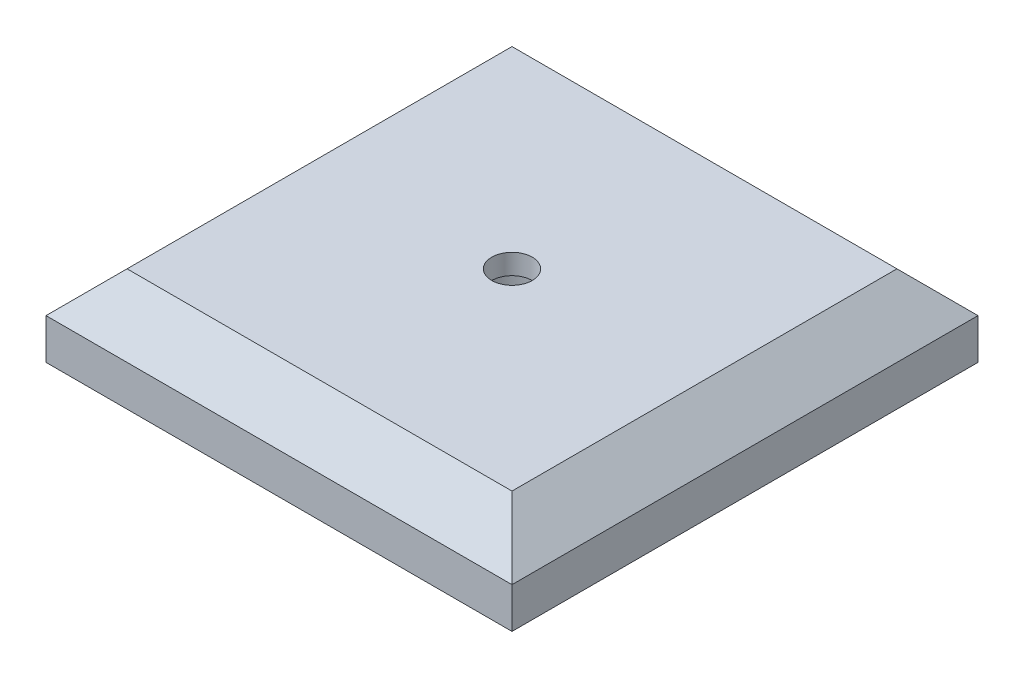
ISO-10303-21;
HEADER;
FILE_DESCRIPTION(('STEP AP214'),'2;1');
FILE_NAME('part.step','',(''),(''),'','','');
FILE_SCHEMA(('AUTOMOTIVE_DESIGN { 1 0 10303 214 1 1 1 1 }'));
ENDSEC;
DATA;
#1=APPLICATION_CONTEXT('core data for automotive mechanical design processes');
#2=APPLICATION_PROTOCOL_DEFINITION('international standard','automotive_design',2000,#1);
#3=PRODUCT_CONTEXT('',#1,'mechanical');
#4=PRODUCT('Part','Part','',(#3));
#5=PRODUCT_RELATED_PRODUCT_CATEGORY('part','',(#4));
#6=PRODUCT_DEFINITION_FORMATION('','',#4);
#7=PRODUCT_DEFINITION_CONTEXT('part definition',#1,'design');
#8=PRODUCT_DEFINITION('design','',#6,#7);
#9=PRODUCT_DEFINITION_SHAPE('','',#8);
#10=(LENGTH_UNIT() NAMED_UNIT(*) SI_UNIT(.MILLI.,.METRE.));
#11=(NAMED_UNIT(*) PLANE_ANGLE_UNIT() SI_UNIT($,.RADIAN.));
#12=(NAMED_UNIT(*) SI_UNIT($,.STERADIAN.) SOLID_ANGLE_UNIT());
#13=UNCERTAINTY_MEASURE_WITH_UNIT(LENGTH_MEASURE(1.E-05),#10,'distance_accuracy_value','');
#14=(GEOMETRIC_REPRESENTATION_CONTEXT(3) GLOBAL_UNCERTAINTY_ASSIGNED_CONTEXT((#13)) GLOBAL_UNIT_ASSIGNED_CONTEXT((#10,
#11,#12)) REPRESENTATION_CONTEXT('',''));
#15=CARTESIAN_POINT('',(0.,0.,0.));
#16=DIRECTION('',(0.,0.,1.));
#17=DIRECTION('',(1.,0.,0.));
#18=AXIS2_PLACEMENT_3D('',#15,#16,#17);
#19=CARTESIAN_POINT('',(14.375,2.5,-14.375));
#20=DIRECTION('',(-1.,0.,0.));
#21=DIRECTION('',(0.,0.,1.));
#22=AXIS2_PLACEMENT_3D('',#19,#20,#21);
#23=PLANE('',#22);
#24=DIRECTION('',(0.,0.,-1.));
#25=VECTOR('',#24,1.);
#26=CARTESIAN_POINT('',(14.375,0.,-14.375));
#27=LINE('',#26,#25);
#28=CARTESIAN_POINT('',(14.375,0.,14.375));
#29=VERTEX_POINT('',#28);
#30=CARTESIAN_POINT('',(14.375,0.,-14.375));
#31=VERTEX_POINT('',#30);
#32=EDGE_CURVE('E141',#29,#31,#27,.T.);
#33=ORIENTED_EDGE('',*,*,#32,.T.);
#34=DIRECTION('',(0.,-1.,0.));
#35=VECTOR('',#34,1.);
#36=CARTESIAN_POINT('',(14.375,2.5,-14.375));
#37=LINE('',#36,#35);
#38=CARTESIAN_POINT('',(14.375,2.5,-14.375));
#39=VERTEX_POINT('',#38);
#40=EDGE_CURVE('E11',#39,#31,#37,.T.);
#41=ORIENTED_EDGE('',*,*,#40,.F.);
#42=DIRECTION('',(0.,0.,-1.));
#43=VECTOR('',#42,1.);
#44=CARTESIAN_POINT('',(14.375,2.5,-14.375));
#45=LINE('',#44,#43);
#46=CARTESIAN_POINT('',(14.375,2.5,14.375));
#47=VERTEX_POINT('',#46);
#48=EDGE_CURVE('E94',#47,#39,#45,.T.);
#49=ORIENTED_EDGE('',*,*,#48,.F.);
#50=DIRECTION('',(0.,-1.,0.));
#51=VECTOR('',#50,1.);
#52=CARTESIAN_POINT('',(14.375,2.5,14.375));
#53=LINE('',#52,#51);
#54=EDGE_CURVE('E96',#47,#29,#53,.T.);
#55=ORIENTED_EDGE('',*,*,#54,.T.);
#56=EDGE_LOOP('',(#33,#41,#49,#55));
#57=FACE_BOUND('',#56,.T.);
#58=ADVANCED_FACE('F34',(#57),#23,.F.);
#59=CARTESIAN_POINT('',(-14.375,2.5,-14.375));
#60=DIRECTION('',(0.,0.,1.));
#61=DIRECTION('',(1.,0.,0.));
#62=AXIS2_PLACEMENT_3D('',#59,#60,#61);
#63=PLANE('',#62);
#64=DIRECTION('',(-1.,0.,0.));
#65=VECTOR('',#64,1.);
#66=CARTESIAN_POINT('',(-14.375,0.,-14.375));
#67=LINE('',#66,#65);
#68=CARTESIAN_POINT('',(-14.375,0.,-14.375));
#69=VERTEX_POINT('',#68);
#70=EDGE_CURVE('E143',#31,#69,#67,.T.);
#71=ORIENTED_EDGE('',*,*,#70,.T.);
#72=DIRECTION('',(0.,-1.,0.));
#73=VECTOR('',#72,1.);
#74=CARTESIAN_POINT('',(-14.375,2.5,-14.375));
#75=LINE('',#74,#73);
#76=CARTESIAN_POINT('',(-14.375,2.5,-14.375));
#77=VERTEX_POINT('',#76);
#78=EDGE_CURVE('E42',#77,#69,#75,.T.);
#79=ORIENTED_EDGE('',*,*,#78,.F.);
#80=DIRECTION('',(-1.,0.,0.));
#81=VECTOR('',#80,1.);
#82=CARTESIAN_POINT('',(-14.375,2.5,-14.375));
#83=LINE('',#82,#81);
#84=EDGE_CURVE('E76',#39,#77,#83,.T.);
#85=ORIENTED_EDGE('',*,*,#84,.F.);
#86=ORIENTED_EDGE('',*,*,#40,.T.);
#87=EDGE_LOOP('',(#71,#79,#85,#86));
#88=FACE_BOUND('',#87,.T.);
#89=ADVANCED_FACE('F150',(#88),#63,.F.);
#90=CARTESIAN_POINT('',(-14.375,2.5,-14.375));
#91=DIRECTION('',(1.,0.,0.));
#92=DIRECTION('',(0.,0.,-1.));
#93=AXIS2_PLACEMENT_3D('',#90,#91,#92);
#94=PLANE('',#93);
#95=DIRECTION('',(0.,0.,1.));
#96=VECTOR('',#95,1.);
#97=CARTESIAN_POINT('',(-14.375,0.,-14.375));
#98=LINE('',#97,#96);
#99=CARTESIAN_POINT('',(-14.375,0.,14.375));
#100=VERTEX_POINT('',#99);
#101=EDGE_CURVE('E66',#69,#100,#98,.T.);
#102=ORIENTED_EDGE('',*,*,#101,.T.);
#103=DIRECTION('',(0.,-1.,0.));
#104=VECTOR('',#103,1.);
#105=CARTESIAN_POINT('',(-14.375,2.5,14.375));
#106=LINE('',#105,#104);
#107=CARTESIAN_POINT('',(-14.375,2.5,14.375));
#108=VERTEX_POINT('',#107);
#109=EDGE_CURVE('E50',#108,#100,#106,.T.);
#110=ORIENTED_EDGE('',*,*,#109,.F.);
#111=DIRECTION('',(0.,0.,1.));
#112=VECTOR('',#111,1.);
#113=CARTESIAN_POINT('',(-14.375,2.5,-14.375));
#114=LINE('',#113,#112);
#115=EDGE_CURVE('E117',#77,#108,#114,.T.);
#116=ORIENTED_EDGE('',*,*,#115,.F.);
#117=ORIENTED_EDGE('',*,*,#78,.T.);
#118=EDGE_LOOP('',(#102,#110,#116,#117));
#119=FACE_BOUND('',#118,.T.);
#120=ADVANCED_FACE('F147',(#119),#94,.F.);
#121=CARTESIAN_POINT('',(-14.375,2.5,14.375));
#122=DIRECTION('',(0.,0.,-1.));
#123=DIRECTION('',(-1.,0.,0.));
#124=AXIS2_PLACEMENT_3D('',#121,#122,#123);
#125=PLANE('',#124);
#126=DIRECTION('',(1.,0.,0.));
#127=VECTOR('',#126,1.);
#128=CARTESIAN_POINT('',(-14.375,0.,14.375));
#129=LINE('',#128,#127);
#130=EDGE_CURVE('E71',#100,#29,#129,.T.);
#131=ORIENTED_EDGE('',*,*,#130,.T.);
#132=ORIENTED_EDGE('',*,*,#54,.F.);
#133=DIRECTION('',(1.,0.,0.));
#134=VECTOR('',#133,1.);
#135=CARTESIAN_POINT('',(-14.375,2.5,14.375));
#136=LINE('',#135,#134);
#137=EDGE_CURVE('E105',#108,#47,#136,.T.);
#138=ORIENTED_EDGE('',*,*,#137,.F.);
#139=ORIENTED_EDGE('',*,*,#109,.T.);
#140=EDGE_LOOP('',(#131,#132,#138,#139));
#141=FACE_BOUND('',#140,.T.);
#142=ADVANCED_FACE('F104',(#141),#125,.F.);
#143=CARTESIAN_POINT('',(0.,0.,0.));
#144=DIRECTION('',(0.,1.,0.));
#145=DIRECTION('',(0.,0.,1.));
#146=AXIS2_PLACEMENT_3D('',#143,#144,#145);
#147=PLANE('',#146);
#148=CARTESIAN_POINT('',(0.,0.,0.));
#149=DIRECTION('',(0.,-1.,0.));
#150=DIRECTION('',(0.,0.,-1.));
#151=AXIS2_PLACEMENT_3D('',#148,#149,#150);
#152=CIRCLE('',#151,2.5);
#153=CARTESIAN_POINT('',(0.,0.,-2.5));
#154=VERTEX_POINT('',#153);
#155=EDGE_CURVE('E201',#154,#154,#152,.T.);
#156=ORIENTED_EDGE('',*,*,#155,.F.);
#157=EDGE_LOOP('',(#156));
#158=FACE_BOUND('',#157,.T.);
#159=ORIENTED_EDGE('',*,*,#32,.F.);
#160=ORIENTED_EDGE('',*,*,#130,.F.);
#161=ORIENTED_EDGE('',*,*,#101,.F.);
#162=ORIENTED_EDGE('',*,*,#70,.F.);
#163=EDGE_LOOP('',(#159,#160,#161,#162));
#164=FACE_BOUND('',#163,.T.);
#165=ADVANCED_FACE('F149',(#158,#164),#147,.F.);
#166=CARTESIAN_POINT('',(14.375,2.5,-14.375));
#167=DIRECTION('',(0.707106781186546,0.707106781186549,0.));
#168=DIRECTION('',(-0.707106781186549,0.707106781186546,0.));
#169=AXIS2_PLACEMENT_3D('',#166,#167,#168);
#170=PLANE('',#169);
#171=ORIENTED_EDGE('',*,*,#48,.T.);
#172=DIRECTION('',(0.577350269189627,-0.577350269189624,-0.577350269189626));
#173=VECTOR('',#172,1.);
#174=CARTESIAN_POINT('',(4.79166666666664,12.0833333333333,-4.79166666666665));
#175=LINE('',#174,#173);
#176=CARTESIAN_POINT('',(11.875,5.,-11.875));
#177=VERTEX_POINT('',#176);
#178=EDGE_CURVE('E129',#177,#39,#175,.T.);
#179=ORIENTED_EDGE('',*,*,#178,.F.);
#180=DIRECTION('',(0.,0.,1.));
#181=VECTOR('',#180,1.);
#182=CARTESIAN_POINT('',(11.875,5.,-14.375));
#183=LINE('',#182,#181);
#184=CARTESIAN_POINT('',(11.875,5.,11.875));
#185=VERTEX_POINT('',#184);
#186=EDGE_CURVE('E121',#185,#177,#183,.F.);
#187=ORIENTED_EDGE('',*,*,#186,.F.);
#188=DIRECTION('',(0.577350269189627,-0.577350269189624,0.577350269189626));
#189=VECTOR('',#188,1.);
#190=CARTESIAN_POINT('',(4.79166666666664,12.0833333333333,4.79166666666665));
#191=LINE('',#190,#189);
#192=EDGE_CURVE('E113',#185,#47,#191,.T.);
#193=ORIENTED_EDGE('',*,*,#192,.T.);
#194=EDGE_LOOP('',(#171,#179,#187,#193));
#195=FACE_BOUND('',#194,.T.);
#196=ADVANCED_FACE('F119',(#195),#170,.T.);
#197=CARTESIAN_POINT('',(-14.375,2.5,-14.375));
#198=DIRECTION('',(0.,0.707106781186549,-0.707106781186546));
#199=DIRECTION('',(0.,0.707106781186546,0.707106781186549));
#200=AXIS2_PLACEMENT_3D('',#197,#198,#199);
#201=PLANE('',#200);
#202=ORIENTED_EDGE('',*,*,#84,.T.);
#203=DIRECTION('',(-0.577350269189627,-0.577350269189624,-0.577350269189626));
#204=VECTOR('',#203,1.);
#205=CARTESIAN_POINT('',(-14.375,2.5,-14.375));
#206=LINE('',#205,#204);
#207=CARTESIAN_POINT('',(-11.875,5.,-11.875));
#208=VERTEX_POINT('',#207);
#209=EDGE_CURVE('E124',#208,#77,#206,.T.);
#210=ORIENTED_EDGE('',*,*,#209,.F.);
#211=DIRECTION('',(1.,0.,0.));
#212=VECTOR('',#211,1.);
#213=CARTESIAN_POINT('',(-14.375,5.,-11.875));
#214=LINE('',#213,#212);
#215=EDGE_CURVE('E135',#177,#208,#214,.F.);
#216=ORIENTED_EDGE('',*,*,#215,.F.);
#217=ORIENTED_EDGE('',*,*,#178,.T.);
#218=EDGE_LOOP('',(#202,#210,#216,#217));
#219=FACE_BOUND('',#218,.T.);
#220=ADVANCED_FACE('F163',(#219),#201,.T.);
#221=CARTESIAN_POINT('',(-14.375,2.5,-14.375));
#222=DIRECTION('',(-0.707106781186546,0.707106781186549,0.));
#223=DIRECTION('',(-0.707106781186549,-0.707106781186546,0.));
#224=AXIS2_PLACEMENT_3D('',#221,#222,#223);
#225=PLANE('',#224);
#226=ORIENTED_EDGE('',*,*,#115,.T.);
#227=DIRECTION('',(-0.577350269189627,-0.577350269189624,0.577350269189626));
#228=VECTOR('',#227,1.);
#229=CARTESIAN_POINT('',(-14.375,2.5,14.375));
#230=LINE('',#229,#228);
#231=CARTESIAN_POINT('',(-11.875,5.,11.875));
#232=VERTEX_POINT('',#231);
#233=EDGE_CURVE('E116',#232,#108,#230,.T.);
#234=ORIENTED_EDGE('',*,*,#233,.F.);
#235=DIRECTION('',(0.,0.,-1.));
#236=VECTOR('',#235,1.);
#237=CARTESIAN_POINT('',(-11.875,5.,-14.375));
#238=LINE('',#237,#236);
#239=EDGE_CURVE('E126',#208,#232,#238,.F.);
#240=ORIENTED_EDGE('',*,*,#239,.F.);
#241=ORIENTED_EDGE('',*,*,#209,.T.);
#242=EDGE_LOOP('',(#226,#234,#240,#241));
#243=FACE_BOUND('',#242,.T.);
#244=ADVANCED_FACE('F166',(#243),#225,.T.);
#245=CARTESIAN_POINT('',(-14.375,2.5,14.375));
#246=DIRECTION('',(0.,0.707106781186549,0.707106781186546));
#247=DIRECTION('',(0.,-0.707106781186546,0.707106781186549));
#248=AXIS2_PLACEMENT_3D('',#245,#246,#247);
#249=PLANE('',#248);
#250=ORIENTED_EDGE('',*,*,#137,.T.);
#251=ORIENTED_EDGE('',*,*,#192,.F.);
#252=DIRECTION('',(-1.,0.,0.));
#253=VECTOR('',#252,1.);
#254=CARTESIAN_POINT('',(-14.375,5.,11.875));
#255=LINE('',#254,#253);
#256=EDGE_CURVE('E122',#232,#185,#255,.F.);
#257=ORIENTED_EDGE('',*,*,#256,.F.);
#258=ORIENTED_EDGE('',*,*,#233,.T.);
#259=EDGE_LOOP('',(#250,#251,#257,#258));
#260=FACE_BOUND('',#259,.T.);
#261=ADVANCED_FACE('F111',(#260),#249,.T.);
#262=CARTESIAN_POINT('',(0.,5.,0.));
#263=DIRECTION('',(0.,1.,0.));
#264=DIRECTION('',(0.,0.,1.));
#265=AXIS2_PLACEMENT_3D('',#262,#263,#264);
#266=PLANE('',#265);
#267=CARTESIAN_POINT('',(0.,5.,0.));
#268=DIRECTION('',(0.,1.,0.));
#269=DIRECTION('',(0.,0.,1.));
#270=AXIS2_PLACEMENT_3D('',#267,#268,#269);
#271=CIRCLE('',#270,1.25);
#272=CARTESIAN_POINT('',(0.,5.,1.25));
#273=VERTEX_POINT('',#272);
#274=EDGE_CURVE('E136',#273,#273,#271,.T.);
#275=ORIENTED_EDGE('',*,*,#274,.F.);
#276=EDGE_LOOP('',(#275));
#277=FACE_BOUND('',#276,.T.);
#278=ORIENTED_EDGE('',*,*,#186,.T.);
#279=ORIENTED_EDGE('',*,*,#215,.T.);
#280=ORIENTED_EDGE('',*,*,#239,.T.);
#281=ORIENTED_EDGE('',*,*,#256,.T.);
#282=EDGE_LOOP('',(#278,#279,#280,#281));
#283=FACE_BOUND('',#282,.T.);
#284=ADVANCED_FACE('F173',(#277,#283),#266,.T.);
#285=CARTESIAN_POINT('',(0.,3.75,0.));
#286=DIRECTION('',(0.,1.,0.));
#287=DIRECTION('',(0.,0.,1.));
#288=AXIS2_PLACEMENT_3D('',#285,#286,#287);
#289=CYLINDRICAL_SURFACE('',#288,1.25);
#290=CARTESIAN_POINT('',(0.,3.75,0.));
#291=DIRECTION('',(0.,1.,0.));
#292=DIRECTION('',(0.,0.,1.));
#293=AXIS2_PLACEMENT_3D('',#290,#291,#292);
#294=CIRCLE('',#293,1.25);
#295=CARTESIAN_POINT('',(0.,3.75,1.25));
#296=VERTEX_POINT('',#295);
#297=EDGE_CURVE('E198',#296,#296,#294,.T.);
#298=ORIENTED_EDGE('',*,*,#297,.F.);
#299=EDGE_LOOP('',(#298));
#300=FACE_BOUND('',#299,.T.);
#301=ORIENTED_EDGE('',*,*,#274,.T.);
#302=EDGE_LOOP('',(#301));
#303=FACE_BOUND('',#302,.T.);
#304=ADVANCED_FACE('F178',(#300,#303),#289,.F.);
#305=CARTESIAN_POINT('',(0.,3.75,0.));
#306=DIRECTION('',(0.,-1.,0.));
#307=DIRECTION('',(0.,0.,-1.));
#308=AXIS2_PLACEMENT_3D('',#305,#306,#307);
#309=PLANE('',#308);
#310=CARTESIAN_POINT('',(0.,3.75,0.));
#311=DIRECTION('',(0.,-1.,0.));
#312=DIRECTION('',(0.,0.,-1.));
#313=AXIS2_PLACEMENT_3D('',#310,#311,#312);
#314=CIRCLE('',#313,2.5);
#315=CARTESIAN_POINT('',(0.,3.75,-2.5));
#316=VERTEX_POINT('',#315);
#317=EDGE_CURVE('E195',#316,#316,#314,.T.);
#318=ORIENTED_EDGE('',*,*,#317,.T.);
#319=EDGE_LOOP('',(#318));
#320=FACE_BOUND('',#319,.T.);
#321=ORIENTED_EDGE('',*,*,#297,.T.);
#322=EDGE_LOOP('',(#321));
#323=FACE_BOUND('',#322,.T.);
#324=ADVANCED_FACE('F182',(#320,#323),#309,.T.);
#325=CARTESIAN_POINT('',(0.,3.75,0.));
#326=DIRECTION('',(0.,-1.,0.));
#327=DIRECTION('',(0.,0.,-1.));
#328=AXIS2_PLACEMENT_3D('',#325,#326,#327);
#329=CYLINDRICAL_SURFACE('',#328,2.5);
#330=ORIENTED_EDGE('',*,*,#317,.F.);
#331=EDGE_LOOP('',(#330));
#332=FACE_BOUND('',#331,.T.);
#333=ORIENTED_EDGE('',*,*,#155,.T.);
#334=EDGE_LOOP('',(#333));
#335=FACE_BOUND('',#334,.T.);
#336=ADVANCED_FACE('F184',(#332,#335),#329,.F.);
#337=CLOSED_SHELL('',(#58,#89,#120,#142,#165,#196,#220,#244,#261,#284,#304,#324,#336));
#338=MANIFOLD_SOLID_BREP('B2',#337);
#339=ADVANCED_BREP_SHAPE_REPRESENTATION('',(#18,#338),#14);
#340=SHAPE_DEFINITION_REPRESENTATION(#9,#339);
ENDSEC;
END-ISO-10303-21;
